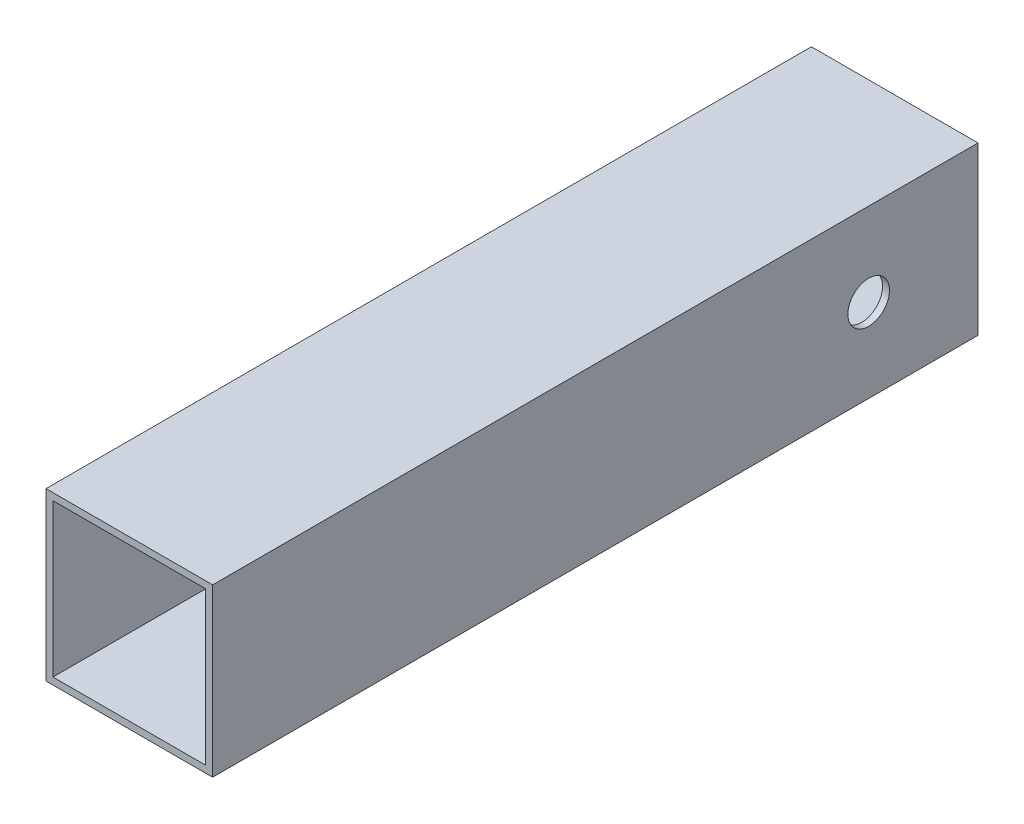
ISO-10303-21;
HEADER;
FILE_DESCRIPTION(('STEP AP214'),'2;1');
FILE_NAME('part.step','',(''),(''),'','','');
FILE_SCHEMA(('AUTOMOTIVE_DESIGN { 1 0 10303 214 1 1 1 1 }'));
ENDSEC;
DATA;
#1=APPLICATION_CONTEXT('core data for automotive mechanical design processes');
#2=APPLICATION_PROTOCOL_DEFINITION('international standard','automotive_design',2000,#1);
#3=PRODUCT_CONTEXT('',#1,'mechanical');
#4=PRODUCT('Part','Part','',(#3));
#5=PRODUCT_RELATED_PRODUCT_CATEGORY('part','',(#4));
#6=PRODUCT_DEFINITION_FORMATION('','',#4);
#7=PRODUCT_DEFINITION_CONTEXT('part definition',#1,'design');
#8=PRODUCT_DEFINITION('design','',#6,#7);
#9=PRODUCT_DEFINITION_SHAPE('','',#8);
#10=(LENGTH_UNIT() NAMED_UNIT(*) SI_UNIT(.MILLI.,.METRE.));
#11=(NAMED_UNIT(*) PLANE_ANGLE_UNIT() SI_UNIT($,.RADIAN.));
#12=(NAMED_UNIT(*) SI_UNIT($,.STERADIAN.) SOLID_ANGLE_UNIT());
#13=UNCERTAINTY_MEASURE_WITH_UNIT(LENGTH_MEASURE(1.E-05),#10,'distance_accuracy_value','');
#14=(GEOMETRIC_REPRESENTATION_CONTEXT(3) GLOBAL_UNCERTAINTY_ASSIGNED_CONTEXT((#13)) GLOBAL_UNIT_ASSIGNED_CONTEXT((#10,
#11,#12)) REPRESENTATION_CONTEXT('',''));
#15=CARTESIAN_POINT('',(0.,0.,0.));
#16=DIRECTION('',(0.,0.,1.));
#17=DIRECTION('',(1.,0.,0.));
#18=AXIS2_PLACEMENT_3D('',#15,#16,#17);
#19=CARTESIAN_POINT('',(0.,0.,350.));
#20=DIRECTION('',(0.,0.,1.));
#21=DIRECTION('',(1.,0.,0.));
#22=AXIS2_PLACEMENT_3D('',#19,#20,#21);
#23=PLANE('',#22);
#24=DIRECTION('',(0.,-1.,0.));
#25=VECTOR('',#24,1.);
#26=CARTESIAN_POINT('',(0.,0.,350.));
#27=LINE('',#26,#25);
#28=CARTESIAN_POINT('',(0.,0.,350.));
#29=VERTEX_POINT('',#28);
#30=CARTESIAN_POINT('',(0.,-76.2,350.));
#31=VERTEX_POINT('',#30);
#32=EDGE_CURVE('E136',#29,#31,#27,.T.);
#33=ORIENTED_EDGE('',*,*,#32,.T.);
#34=DIRECTION('',(1.,0.,0.));
#35=VECTOR('',#34,1.);
#36=CARTESIAN_POINT('',(0.,-76.2,350.));
#37=LINE('',#36,#35);
#38=CARTESIAN_POINT('',(76.2,-76.2,350.));
#39=VERTEX_POINT('',#38);
#40=EDGE_CURVE('E139',#31,#39,#37,.T.);
#41=ORIENTED_EDGE('',*,*,#40,.T.);
#42=DIRECTION('',(0.,1.,0.));
#43=VECTOR('',#42,1.);
#44=CARTESIAN_POINT('',(76.2,0.,350.));
#45=LINE('',#44,#43);
#46=CARTESIAN_POINT('',(76.2,0.,350.));
#47=VERTEX_POINT('',#46);
#48=EDGE_CURVE('E142',#39,#47,#45,.T.);
#49=ORIENTED_EDGE('',*,*,#48,.T.);
#50=DIRECTION('',(-1.,0.,0.));
#51=VECTOR('',#50,1.);
#52=CARTESIAN_POINT('',(0.,0.,350.));
#53=LINE('',#52,#51);
#54=EDGE_CURVE('E144',#47,#29,#53,.T.);
#55=ORIENTED_EDGE('',*,*,#54,.T.);
#56=EDGE_LOOP('',(#33,#41,#49,#55));
#57=FACE_BOUND('',#56,.T.);
#58=DIRECTION('',(1.,0.,0.));
#59=VECTOR('',#58,1.);
#60=CARTESIAN_POINT('',(3.17500000000001,-73.025,350.));
#61=LINE('',#60,#59);
#62=CARTESIAN_POINT('',(3.17500000000001,-73.025,350.));
#63=VERTEX_POINT('',#62);
#64=CARTESIAN_POINT('',(73.025,-73.025,350.));
#65=VERTEX_POINT('',#64);
#66=EDGE_CURVE('E106',#63,#65,#61,.T.);
#67=ORIENTED_EDGE('',*,*,#66,.F.);
#68=DIRECTION('',(0.,-1.,0.));
#69=VECTOR('',#68,1.);
#70=CARTESIAN_POINT('',(3.175,-3.175,350.));
#71=LINE('',#70,#69);
#72=CARTESIAN_POINT('',(3.175,-3.175,350.));
#73=VERTEX_POINT('',#72);
#74=EDGE_CURVE('E98',#73,#63,#71,.T.);
#75=ORIENTED_EDGE('',*,*,#74,.F.);
#76=DIRECTION('',(-1.,0.,0.));
#77=VECTOR('',#76,1.);
#78=CARTESIAN_POINT('',(3.175,-3.175,350.));
#79=LINE('',#78,#77);
#80=CARTESIAN_POINT('',(73.025,-3.175,350.));
#81=VERTEX_POINT('',#80);
#82=EDGE_CURVE('E120',#81,#73,#79,.T.);
#83=ORIENTED_EDGE('',*,*,#82,.F.);
#84=DIRECTION('',(0.,1.,0.));
#85=VECTOR('',#84,1.);
#86=CARTESIAN_POINT('',(73.025,-3.175,350.));
#87=LINE('',#86,#85);
#88=EDGE_CURVE('E118',#65,#81,#87,.T.);
#89=ORIENTED_EDGE('',*,*,#88,.F.);
#90=EDGE_LOOP('',(#67,#75,#83,#89));
#91=FACE_BOUND('',#90,.T.);
#92=ADVANCED_FACE('F32',(#57,#91),#23,.T.);
#93=CARTESIAN_POINT('',(0.,0.,0.));
#94=DIRECTION('',(0.,0.,1.));
#95=DIRECTION('',(1.,0.,0.));
#96=AXIS2_PLACEMENT_3D('',#93,#94,#95);
#97=PLANE('',#96);
#98=DIRECTION('',(0.,-1.,0.));
#99=VECTOR('',#98,1.);
#100=CARTESIAN_POINT('',(0.,0.,0.));
#101=LINE('',#100,#99);
#102=CARTESIAN_POINT('',(0.,0.,0.));
#103=VERTEX_POINT('',#102);
#104=CARTESIAN_POINT('',(0.,-76.2,0.));
#105=VERTEX_POINT('',#104);
#106=EDGE_CURVE('E114',#103,#105,#101,.T.);
#107=ORIENTED_EDGE('',*,*,#106,.F.);
#108=DIRECTION('',(-1.,0.,0.));
#109=VECTOR('',#108,1.);
#110=CARTESIAN_POINT('',(0.,0.,0.));
#111=LINE('',#110,#109);
#112=CARTESIAN_POINT('',(76.2,0.,0.));
#113=VERTEX_POINT('',#112);
#114=EDGE_CURVE('E140',#113,#103,#111,.T.);
#115=ORIENTED_EDGE('',*,*,#114,.F.);
#116=DIRECTION('',(0.,1.,0.));
#117=VECTOR('',#116,1.);
#118=CARTESIAN_POINT('',(76.2,0.,0.));
#119=LINE('',#118,#117);
#120=CARTESIAN_POINT('',(76.2,-76.2,0.));
#121=VERTEX_POINT('',#120);
#122=EDGE_CURVE('E151',#121,#113,#119,.T.);
#123=ORIENTED_EDGE('',*,*,#122,.F.);
#124=DIRECTION('',(1.,0.,0.));
#125=VECTOR('',#124,1.);
#126=CARTESIAN_POINT('',(0.,-76.2,0.));
#127=LINE('',#126,#125);
#128=EDGE_CURVE('E149',#105,#121,#127,.T.);
#129=ORIENTED_EDGE('',*,*,#128,.F.);
#130=EDGE_LOOP('',(#107,#115,#123,#129));
#131=FACE_BOUND('',#130,.T.);
#132=DIRECTION('',(0.,-1.,0.));
#133=VECTOR('',#132,1.);
#134=CARTESIAN_POINT('',(3.175,-3.175,0.));
#135=LINE('',#134,#133);
#136=CARTESIAN_POINT('',(3.175,-3.175,0.));
#137=VERTEX_POINT('',#136);
#138=CARTESIAN_POINT('',(3.17500000000001,-73.025,0.));
#139=VERTEX_POINT('',#138);
#140=EDGE_CURVE('E56',#137,#139,#135,.T.);
#141=ORIENTED_EDGE('',*,*,#140,.T.);
#142=DIRECTION('',(1.,0.,0.));
#143=VECTOR('',#142,1.);
#144=CARTESIAN_POINT('',(3.17500000000001,-73.025,0.));
#145=LINE('',#144,#143);
#146=CARTESIAN_POINT('',(73.025,-73.025,0.));
#147=VERTEX_POINT('',#146);
#148=EDGE_CURVE('E113',#139,#147,#145,.T.);
#149=ORIENTED_EDGE('',*,*,#148,.T.);
#150=DIRECTION('',(0.,1.,0.));
#151=VECTOR('',#150,1.);
#152=CARTESIAN_POINT('',(73.025,-3.175,0.));
#153=LINE('',#152,#151);
#154=CARTESIAN_POINT('',(73.025,-3.175,0.));
#155=VERTEX_POINT('',#154);
#156=EDGE_CURVE('E128',#147,#155,#153,.T.);
#157=ORIENTED_EDGE('',*,*,#156,.T.);
#158=DIRECTION('',(-1.,0.,0.));
#159=VECTOR('',#158,1.);
#160=CARTESIAN_POINT('',(3.175,-3.175,0.));
#161=LINE('',#160,#159);
#162=EDGE_CURVE('E107',#155,#137,#161,.T.);
#163=ORIENTED_EDGE('',*,*,#162,.T.);
#164=EDGE_LOOP('',(#141,#149,#157,#163));
#165=FACE_BOUND('',#164,.T.);
#166=ADVANCED_FACE('F170',(#131,#165),#97,.F.);
#167=CARTESIAN_POINT('',(0.,0.,350.));
#168=DIRECTION('',(1.,0.,0.));
#169=DIRECTION('',(0.,1.,0.));
#170=AXIS2_PLACEMENT_3D('',#167,#168,#169);
#171=PLANE('',#170);
#172=CARTESIAN_POINT('',(0.,-38.1,50.));
#173=DIRECTION('',(-1.,0.,0.));
#174=DIRECTION('',(0.,-1.,0.));
#175=AXIS2_PLACEMENT_3D('',#172,#173,#174);
#176=CIRCLE('',#175,9.52500000000002);
#177=CARTESIAN_POINT('',(0.,-47.625,50.));
#178=VERTEX_POINT('',#177);
#179=EDGE_CURVE('E217',#178,#178,#176,.T.);
#180=ORIENTED_EDGE('',*,*,#179,.F.);
#181=EDGE_LOOP('',(#180));
#182=FACE_BOUND('',#181,.T.);
#183=ORIENTED_EDGE('',*,*,#106,.T.);
#184=DIRECTION('',(0.,0.,-1.));
#185=VECTOR('',#184,1.);
#186=CARTESIAN_POINT('',(0.,-76.2,350.));
#187=LINE('',#186,#185);
#188=EDGE_CURVE('E11',#31,#105,#187,.T.);
#189=ORIENTED_EDGE('',*,*,#188,.F.);
#190=ORIENTED_EDGE('',*,*,#32,.F.);
#191=DIRECTION('',(0.,0.,-1.));
#192=VECTOR('',#191,1.);
#193=CARTESIAN_POINT('',(0.,0.,350.));
#194=LINE('',#193,#192);
#195=EDGE_CURVE('E146',#29,#103,#194,.T.);
#196=ORIENTED_EDGE('',*,*,#195,.T.);
#197=EDGE_LOOP('',(#183,#189,#190,#196));
#198=FACE_BOUND('',#197,.T.);
#199=ADVANCED_FACE('F34',(#182,#198),#171,.F.);
#200=CARTESIAN_POINT('',(0.,-76.2,350.));
#201=DIRECTION('',(0.,1.,0.));
#202=DIRECTION('',(0.,0.,1.));
#203=AXIS2_PLACEMENT_3D('',#200,#201,#202);
#204=PLANE('',#203);
#205=ORIENTED_EDGE('',*,*,#128,.T.);
#206=DIRECTION('',(0.,0.,-1.));
#207=VECTOR('',#206,1.);
#208=CARTESIAN_POINT('',(76.2,-76.2,350.));
#209=LINE('',#208,#207);
#210=EDGE_CURVE('E41',#39,#121,#209,.T.);
#211=ORIENTED_EDGE('',*,*,#210,.F.);
#212=ORIENTED_EDGE('',*,*,#40,.F.);
#213=ORIENTED_EDGE('',*,*,#188,.T.);
#214=EDGE_LOOP('',(#205,#211,#212,#213));
#215=FACE_BOUND('',#214,.T.);
#216=ADVANCED_FACE('F180',(#215),#204,.F.);
#217=CARTESIAN_POINT('',(76.2,0.,350.));
#218=DIRECTION('',(-1.,0.,0.));
#219=DIRECTION('',(0.,-1.,0.));
#220=AXIS2_PLACEMENT_3D('',#217,#218,#219);
#221=PLANE('',#220);
#222=CARTESIAN_POINT('',(76.2,-38.1,50.));
#223=DIRECTION('',(-1.,0.,0.));
#224=DIRECTION('',(0.,-1.,0.));
#225=AXIS2_PLACEMENT_3D('',#222,#223,#224);
#226=CIRCLE('',#225,9.52500000000002);
#227=CARTESIAN_POINT('',(76.2,-47.625,50.));
#228=VERTEX_POINT('',#227);
#229=EDGE_CURVE('E126',#228,#228,#226,.T.);
#230=ORIENTED_EDGE('',*,*,#229,.T.);
#231=EDGE_LOOP('',(#230));
#232=FACE_BOUND('',#231,.T.);
#233=ORIENTED_EDGE('',*,*,#122,.T.);
#234=DIRECTION('',(0.,0.,-1.));
#235=VECTOR('',#234,1.);
#236=CARTESIAN_POINT('',(76.2,0.,350.));
#237=LINE('',#236,#235);
#238=EDGE_CURVE('E156',#47,#113,#237,.T.);
#239=ORIENTED_EDGE('',*,*,#238,.F.);
#240=ORIENTED_EDGE('',*,*,#48,.F.);
#241=ORIENTED_EDGE('',*,*,#210,.T.);
#242=EDGE_LOOP('',(#233,#239,#240,#241));
#243=FACE_BOUND('',#242,.T.);
#244=ADVANCED_FACE('F164',(#232,#243),#221,.F.);
#245=CARTESIAN_POINT('',(0.,0.,350.));
#246=DIRECTION('',(0.,-1.,0.));
#247=DIRECTION('',(0.,0.,-1.));
#248=AXIS2_PLACEMENT_3D('',#245,#246,#247);
#249=PLANE('',#248);
#250=ORIENTED_EDGE('',*,*,#114,.T.);
#251=ORIENTED_EDGE('',*,*,#195,.F.);
#252=ORIENTED_EDGE('',*,*,#54,.F.);
#253=ORIENTED_EDGE('',*,*,#238,.T.);
#254=EDGE_LOOP('',(#250,#251,#252,#253));
#255=FACE_BOUND('',#254,.T.);
#256=ADVANCED_FACE('F174',(#255),#249,.F.);
#257=CARTESIAN_POINT('',(3.175,-3.175,350.));
#258=DIRECTION('',(1.,0.,0.));
#259=DIRECTION('',(0.,1.,0.));
#260=AXIS2_PLACEMENT_3D('',#257,#258,#259);
#261=PLANE('',#260);
#262=CARTESIAN_POINT('',(3.175,-38.1,50.));
#263=DIRECTION('',(1.,0.,0.));
#264=DIRECTION('',(0.,1.,0.));
#265=AXIS2_PLACEMENT_3D('',#262,#263,#264);
#266=CIRCLE('',#265,9.52500000000002);
#267=CARTESIAN_POINT('',(3.175,-28.575,50.));
#268=VERTEX_POINT('',#267);
#269=EDGE_CURVE('E212',#268,#268,#266,.T.);
#270=ORIENTED_EDGE('',*,*,#269,.F.);
#271=EDGE_LOOP('',(#270));
#272=FACE_BOUND('',#271,.T.);
#273=ORIENTED_EDGE('',*,*,#140,.F.);
#274=DIRECTION('',(0.,0.,-1.));
#275=VECTOR('',#274,1.);
#276=CARTESIAN_POINT('',(3.175,-3.175,350.));
#277=LINE('',#276,#275);
#278=EDGE_CURVE('E102',#73,#137,#277,.T.);
#279=ORIENTED_EDGE('',*,*,#278,.F.);
#280=ORIENTED_EDGE('',*,*,#74,.T.);
#281=DIRECTION('',(0.,0.,-1.));
#282=VECTOR('',#281,1.);
#283=CARTESIAN_POINT('',(3.17500000000001,-73.025,350.));
#284=LINE('',#283,#282);
#285=EDGE_CURVE('E101',#63,#139,#284,.T.);
#286=ORIENTED_EDGE('',*,*,#285,.T.);
#287=EDGE_LOOP('',(#273,#279,#280,#286));
#288=FACE_BOUND('',#287,.T.);
#289=ADVANCED_FACE('F100',(#272,#288),#261,.T.);
#290=CARTESIAN_POINT('',(3.17500000000001,-73.025,350.));
#291=DIRECTION('',(0.,1.,0.));
#292=DIRECTION('',(0.,0.,1.));
#293=AXIS2_PLACEMENT_3D('',#290,#291,#292);
#294=PLANE('',#293);
#295=ORIENTED_EDGE('',*,*,#148,.F.);
#296=ORIENTED_EDGE('',*,*,#285,.F.);
#297=ORIENTED_EDGE('',*,*,#66,.T.);
#298=DIRECTION('',(0.,0.,-1.));
#299=VECTOR('',#298,1.);
#300=CARTESIAN_POINT('',(73.025,-73.025,350.));
#301=LINE('',#300,#299);
#302=EDGE_CURVE('E115',#65,#147,#301,.T.);
#303=ORIENTED_EDGE('',*,*,#302,.T.);
#304=EDGE_LOOP('',(#295,#296,#297,#303));
#305=FACE_BOUND('',#304,.T.);
#306=ADVANCED_FACE('F110',(#305),#294,.T.);
#307=CARTESIAN_POINT('',(73.025,-3.175,350.));
#308=DIRECTION('',(-1.,0.,0.));
#309=DIRECTION('',(0.,-1.,0.));
#310=AXIS2_PLACEMENT_3D('',#307,#308,#309);
#311=PLANE('',#310);
#312=CARTESIAN_POINT('',(73.025,-38.1,50.));
#313=DIRECTION('',(-1.,0.,0.));
#314=DIRECTION('',(0.,-1.,0.));
#315=AXIS2_PLACEMENT_3D('',#312,#313,#314);
#316=CIRCLE('',#315,9.52500000000002);
#317=CARTESIAN_POINT('',(73.025,-47.625,50.));
#318=VERTEX_POINT('',#317);
#319=EDGE_CURVE('E36',#318,#318,#316,.T.);
#320=ORIENTED_EDGE('',*,*,#319,.F.);
#321=EDGE_LOOP('',(#320));
#322=FACE_BOUND('',#321,.T.);
#323=ORIENTED_EDGE('',*,*,#156,.F.);
#324=ORIENTED_EDGE('',*,*,#302,.F.);
#325=ORIENTED_EDGE('',*,*,#88,.T.);
#326=DIRECTION('',(0.,0.,-1.));
#327=VECTOR('',#326,1.);
#328=CARTESIAN_POINT('',(73.025,-3.175,350.));
#329=LINE('',#328,#327);
#330=EDGE_CURVE('E48',#81,#155,#329,.T.);
#331=ORIENTED_EDGE('',*,*,#330,.T.);
#332=EDGE_LOOP('',(#323,#324,#325,#331));
#333=FACE_BOUND('',#332,.T.);
#334=ADVANCED_FACE('F209',(#322,#333),#311,.T.);
#335=CARTESIAN_POINT('',(3.175,-3.175,350.));
#336=DIRECTION('',(0.,-1.,0.));
#337=DIRECTION('',(0.,0.,-1.));
#338=AXIS2_PLACEMENT_3D('',#335,#336,#337);
#339=PLANE('',#338);
#340=ORIENTED_EDGE('',*,*,#162,.F.);
#341=ORIENTED_EDGE('',*,*,#330,.F.);
#342=ORIENTED_EDGE('',*,*,#82,.T.);
#343=ORIENTED_EDGE('',*,*,#278,.T.);
#344=EDGE_LOOP('',(#340,#341,#342,#343));
#345=FACE_BOUND('',#344,.T.);
#346=ADVANCED_FACE('F229',(#345),#339,.T.);
#347=CARTESIAN_POINT('',(127.,-38.1,50.));
#348=DIRECTION('',(-1.,0.,0.));
#349=DIRECTION('',(0.,-1.,0.));
#350=AXIS2_PLACEMENT_3D('',#347,#348,#349);
#351=CYLINDRICAL_SURFACE('',#350,9.52500000000002);
#352=ORIENTED_EDGE('',*,*,#319,.T.);
#353=EDGE_LOOP('',(#352));
#354=FACE_BOUND('',#353,.T.);
#355=ORIENTED_EDGE('',*,*,#229,.F.);
#356=EDGE_LOOP('',(#355));
#357=FACE_BOUND('',#356,.T.);
#358=ADVANCED_FACE('F224',(#354,#357),#351,.F.);
#359=ORIENTED_EDGE('',*,*,#269,.T.);
#360=EDGE_LOOP('',(#359));
#361=FACE_BOUND('',#360,.T.);
#362=ORIENTED_EDGE('',*,*,#179,.T.);
#363=EDGE_LOOP('',(#362));
#364=FACE_BOUND('',#363,.T.);
#365=ADVANCED_FACE('F222',(#361,#364),#351,.F.);
#366=CLOSED_SHELL('',(#92,#166,#199,#216,#244,#256,#289,#306,#334,#346,#358,#365));
#367=MANIFOLD_SOLID_BREP('B2',#366);
#368=ADVANCED_BREP_SHAPE_REPRESENTATION('',(#18,#367),#14);
#369=SHAPE_DEFINITION_REPRESENTATION(#9,#368);
ENDSEC;
END-ISO-10303-21;
